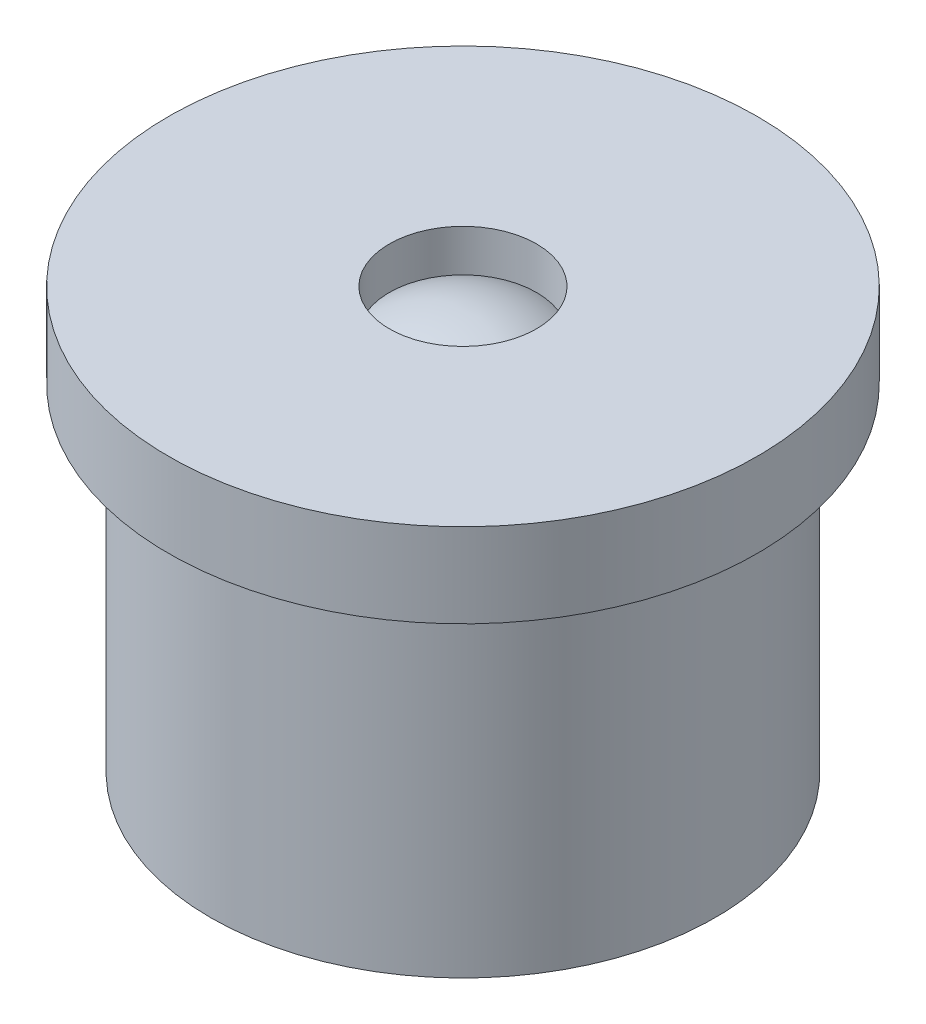
ISO-10303-21;
HEADER;
FILE_DESCRIPTION(('STEP AP214'),'2;1');
FILE_NAME('part.step','',(''),(''),'','','');
FILE_SCHEMA(('AUTOMOTIVE_DESIGN { 1 0 10303 214 1 1 1 1 }'));
ENDSEC;
DATA;
#1=APPLICATION_CONTEXT('core data for automotive mechanical design processes');
#2=APPLICATION_PROTOCOL_DEFINITION('international standard','automotive_design',2000,#1);
#3=PRODUCT_CONTEXT('',#1,'mechanical');
#4=PRODUCT('Part','Part','',(#3));
#5=PRODUCT_RELATED_PRODUCT_CATEGORY('part','',(#4));
#6=PRODUCT_DEFINITION_FORMATION('','',#4);
#7=PRODUCT_DEFINITION_CONTEXT('part definition',#1,'design');
#8=PRODUCT_DEFINITION('design','',#6,#7);
#9=PRODUCT_DEFINITION_SHAPE('','',#8);
#10=(LENGTH_UNIT() NAMED_UNIT(*) SI_UNIT(.MILLI.,.METRE.));
#11=(NAMED_UNIT(*) PLANE_ANGLE_UNIT() SI_UNIT($,.RADIAN.));
#12=(NAMED_UNIT(*) SI_UNIT($,.STERADIAN.) SOLID_ANGLE_UNIT());
#13=UNCERTAINTY_MEASURE_WITH_UNIT(LENGTH_MEASURE(1.E-05),#10,'distance_accuracy_value','');
#14=(GEOMETRIC_REPRESENTATION_CONTEXT(3) GLOBAL_UNCERTAINTY_ASSIGNED_CONTEXT((#13)) GLOBAL_UNIT_ASSIGNED_CONTEXT((#10,
#11,#12)) REPRESENTATION_CONTEXT('',''));
#15=CARTESIAN_POINT('',(0.,0.,0.));
#16=DIRECTION('',(0.,0.,1.));
#17=DIRECTION('',(1.,0.,0.));
#18=AXIS2_PLACEMENT_3D('',#15,#16,#17);
#19=CARTESIAN_POINT('',(0.,6.1875,0.));
#20=DIRECTION('',(0.,-1.,0.));
#21=DIRECTION('',(0.,0.,-1.));
#22=AXIS2_PLACEMENT_3D('',#19,#20,#21);
#23=SPHERICAL_SURFACE('',#22,3.3125);
#24=CARTESIAN_POINT('',(0.,9.,0.));
#25=DIRECTION('',(0.,-1.,0.));
#26=DIRECTION('',(0.,0.,-1.));
#27=AXIS2_PLACEMENT_3D('',#24,#25,#26);
#28=CIRCLE('',#27,1.75);
#29=CARTESIAN_POINT('',(0.,9.,-1.75));
#30=VERTEX_POINT('',#29);
#31=EDGE_CURVE('E10',#30,#30,#28,.T.);
#32=ORIENTED_EDGE('',*,*,#31,.F.);
#33=EDGE_LOOP('',(#32));
#34=FACE_BOUND('',#33,.T.);
#35=ADVANCED_FACE('F32',(#34),#23,.T.);
#36=CARTESIAN_POINT('',(0.,0.,0.));
#37=DIRECTION('',(0.,-1.,0.));
#38=DIRECTION('',(0.,0.,-1.));
#39=AXIS2_PLACEMENT_3D('',#36,#37,#38);
#40=CYLINDRICAL_SURFACE('',#39,1.75);
#41=ORIENTED_EDGE('',*,*,#31,.T.);
#42=EDGE_LOOP('',(#41));
#43=FACE_BOUND('',#42,.T.);
#44=CARTESIAN_POINT('',(0.,10.,0.));
#45=DIRECTION('',(0.,-1.,0.));
#46=DIRECTION('',(0.,0.,-1.));
#47=AXIS2_PLACEMENT_3D('',#44,#45,#46);
#48=CIRCLE('',#47,1.75);
#49=CARTESIAN_POINT('',(0.,10.,-1.75));
#50=VERTEX_POINT('',#49);
#51=EDGE_CURVE('E38',#50,#50,#48,.T.);
#52=ORIENTED_EDGE('',*,*,#51,.F.);
#53=EDGE_LOOP('',(#52));
#54=FACE_BOUND('',#53,.T.);
#55=ADVANCED_FACE('F74',(#43,#54),#40,.F.);
#56=CARTESIAN_POINT('',(0.,10.,-1.75));
#57=DIRECTION('',(0.,1.,0.));
#58=DIRECTION('',(0.,0.,1.));
#59=AXIS2_PLACEMENT_3D('',#56,#57,#58);
#60=PLANE('',#59);
#61=ORIENTED_EDGE('',*,*,#51,.T.);
#62=EDGE_LOOP('',(#61));
#63=FACE_BOUND('',#62,.T.);
#64=CARTESIAN_POINT('',(0.,10.,0.));
#65=DIRECTION('',(0.,-1.,0.));
#66=DIRECTION('',(0.,0.,-1.));
#67=AXIS2_PLACEMENT_3D('',#64,#65,#66);
#68=CIRCLE('',#67,7.);
#69=CARTESIAN_POINT('',(0.,10.,-7.));
#70=VERTEX_POINT('',#69);
#71=EDGE_CURVE('E42',#70,#70,#68,.T.);
#72=ORIENTED_EDGE('',*,*,#71,.F.);
#73=EDGE_LOOP('',(#72));
#74=FACE_BOUND('',#73,.T.);
#75=ADVANCED_FACE('F79',(#63,#74),#60,.T.);
#76=CARTESIAN_POINT('',(0.,0.,0.));
#77=DIRECTION('',(0.,-1.,0.));
#78=DIRECTION('',(0.,0.,-1.));
#79=AXIS2_PLACEMENT_3D('',#76,#77,#78);
#80=CYLINDRICAL_SURFACE('',#79,7.);
#81=ORIENTED_EDGE('',*,*,#71,.T.);
#82=EDGE_LOOP('',(#81));
#83=FACE_BOUND('',#82,.T.);
#84=CARTESIAN_POINT('',(0.,8.,0.));
#85=DIRECTION('',(0.,-1.,0.));
#86=DIRECTION('',(0.,0.,-1.));
#87=AXIS2_PLACEMENT_3D('',#84,#85,#86);
#88=CIRCLE('',#87,7.);
#89=CARTESIAN_POINT('',(0.,8.,-7.));
#90=VERTEX_POINT('',#89);
#91=EDGE_CURVE('E46',#90,#90,#88,.T.);
#92=ORIENTED_EDGE('',*,*,#91,.F.);
#93=EDGE_LOOP('',(#92));
#94=FACE_BOUND('',#93,.T.);
#95=ADVANCED_FACE('F70',(#83,#94),#80,.T.);
#96=CARTESIAN_POINT('',(0.,8.,-7.));
#97=DIRECTION('',(0.,-1.,0.));
#98=DIRECTION('',(0.,0.,-1.));
#99=AXIS2_PLACEMENT_3D('',#96,#97,#98);
#100=PLANE('',#99);
#101=ORIENTED_EDGE('',*,*,#91,.T.);
#102=EDGE_LOOP('',(#101));
#103=FACE_BOUND('',#102,.T.);
#104=CARTESIAN_POINT('',(0.,8.,0.));
#105=DIRECTION('',(0.,-1.,0.));
#106=DIRECTION('',(0.,0.,-1.));
#107=AXIS2_PLACEMENT_3D('',#104,#105,#106);
#108=CIRCLE('',#107,6.);
#109=CARTESIAN_POINT('',(0.,8.,-6.));
#110=VERTEX_POINT('',#109);
#111=EDGE_CURVE('E51',#110,#110,#108,.T.);
#112=ORIENTED_EDGE('',*,*,#111,.F.);
#113=EDGE_LOOP('',(#112));
#114=FACE_BOUND('',#113,.T.);
#115=ADVANCED_FACE('F62',(#103,#114),#100,.T.);
#116=CARTESIAN_POINT('',(0.,0.,0.));
#117=DIRECTION('',(0.,-1.,0.));
#118=DIRECTION('',(0.,0.,-1.));
#119=AXIS2_PLACEMENT_3D('',#116,#117,#118);
#120=CYLINDRICAL_SURFACE('',#119,6.);
#121=ORIENTED_EDGE('',*,*,#111,.T.);
#122=EDGE_LOOP('',(#121));
#123=FACE_BOUND('',#122,.T.);
#124=CARTESIAN_POINT('',(0.,0.,0.));
#125=DIRECTION('',(0.,-1.,0.));
#126=DIRECTION('',(0.,0.,-1.));
#127=AXIS2_PLACEMENT_3D('',#124,#125,#126);
#128=CIRCLE('',#127,6.);
#129=CARTESIAN_POINT('',(0.,0.,-6.));
#130=VERTEX_POINT('',#129);
#131=EDGE_CURVE('E54',#130,#130,#128,.T.);
#132=ORIENTED_EDGE('',*,*,#131,.F.);
#133=EDGE_LOOP('',(#132));
#134=FACE_BOUND('',#133,.T.);
#135=ADVANCED_FACE('F60',(#123,#134),#120,.T.);
#136=CARTESIAN_POINT('',(0.,0.,-6.));
#137=DIRECTION('',(0.,-1.,0.));
#138=DIRECTION('',(0.,0.,-1.));
#139=AXIS2_PLACEMENT_3D('',#136,#137,#138);
#140=PLANE('',#139);
#141=ORIENTED_EDGE('',*,*,#131,.T.);
#142=EDGE_LOOP('',(#141));
#143=FACE_BOUND('',#142,.T.);
#144=ADVANCED_FACE('F58',(#143),#140,.T.);
#145=CLOSED_SHELL('',(#35,#55,#75,#95,#115,#135,#144));
#146=MANIFOLD_SOLID_BREP('B2',#145);
#147=ADVANCED_BREP_SHAPE_REPRESENTATION('',(#18,#146),#14);
#148=SHAPE_DEFINITION_REPRESENTATION(#9,#147);
ENDSEC;
END-ISO-10303-21;
